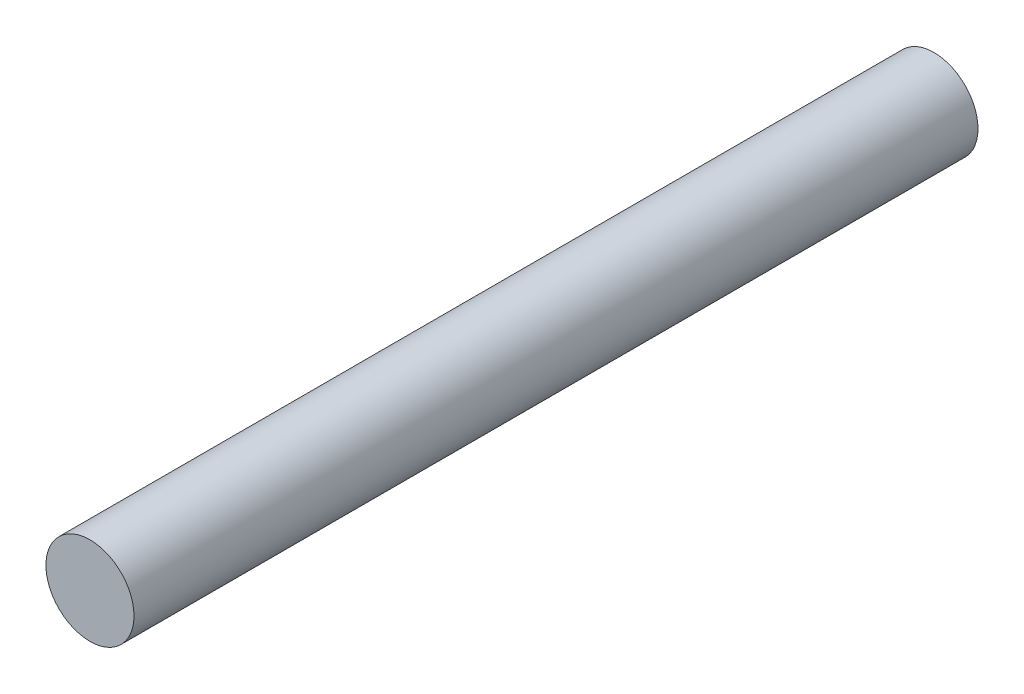
ISO-10303-21;
HEADER;
FILE_DESCRIPTION(('STEP AP214'),'2;1');
FILE_NAME('part.step','',(''),(''),'','','');
FILE_SCHEMA(('AUTOMOTIVE_DESIGN { 1 0 10303 214 1 1 1 1 }'));
ENDSEC;
DATA;
#1=APPLICATION_CONTEXT('core data for automotive mechanical design processes');
#2=APPLICATION_PROTOCOL_DEFINITION('international standard','automotive_design',2000,#1);
#3=PRODUCT_CONTEXT('',#1,'mechanical');
#4=PRODUCT('Part','Part','',(#3));
#5=PRODUCT_RELATED_PRODUCT_CATEGORY('part','',(#4));
#6=PRODUCT_DEFINITION_FORMATION('','',#4);
#7=PRODUCT_DEFINITION_CONTEXT('part definition',#1,'design');
#8=PRODUCT_DEFINITION('design','',#6,#7);
#9=PRODUCT_DEFINITION_SHAPE('','',#8);
#10=(LENGTH_UNIT() NAMED_UNIT(*) SI_UNIT(.MILLI.,.METRE.));
#11=(NAMED_UNIT(*) PLANE_ANGLE_UNIT() SI_UNIT($,.RADIAN.));
#12=(NAMED_UNIT(*) SI_UNIT($,.STERADIAN.) SOLID_ANGLE_UNIT());
#13=UNCERTAINTY_MEASURE_WITH_UNIT(LENGTH_MEASURE(1.E-05),#10,'distance_accuracy_value','');
#14=(GEOMETRIC_REPRESENTATION_CONTEXT(3) GLOBAL_UNCERTAINTY_ASSIGNED_CONTEXT((#13)) GLOBAL_UNIT_ASSIGNED_CONTEXT((#10,
#11,#12)) REPRESENTATION_CONTEXT('',''));
#15=CARTESIAN_POINT('',(0.,0.,0.));
#16=DIRECTION('',(0.,0.,1.));
#17=DIRECTION('',(1.,0.,0.));
#18=AXIS2_PLACEMENT_3D('',#15,#16,#17);
#19=CARTESIAN_POINT('',(0.,0.,115.));
#20=DIRECTION('',(0.,0.,-1.));
#21=DIRECTION('',(-1.,0.,0.));
#22=AXIS2_PLACEMENT_3D('',#19,#20,#21);
#23=CYLINDRICAL_SURFACE('',#22,6.);
#24=CARTESIAN_POINT('',(0.,0.,115.));
#25=DIRECTION('',(0.,0.,1.));
#26=DIRECTION('',(1.,0.,0.));
#27=AXIS2_PLACEMENT_3D('',#24,#25,#26);
#28=CIRCLE('',#27,6.);
#29=CARTESIAN_POINT('',(6.,0.,115.));
#30=VERTEX_POINT('',#29);
#31=EDGE_CURVE('E10',#30,#30,#28,.T.);
#32=ORIENTED_EDGE('',*,*,#31,.F.);
#33=EDGE_LOOP('',(#32));
#34=FACE_BOUND('',#33,.T.);
#35=CARTESIAN_POINT('',(0.,0.,0.));
#36=DIRECTION('',(0.,0.,1.));
#37=DIRECTION('',(1.,0.,0.));
#38=AXIS2_PLACEMENT_3D('',#35,#36,#37);
#39=CIRCLE('',#38,6.);
#40=CARTESIAN_POINT('',(6.,0.,0.));
#41=VERTEX_POINT('',#40);
#42=EDGE_CURVE('E36',#41,#41,#39,.T.);
#43=ORIENTED_EDGE('',*,*,#42,.T.);
#44=EDGE_LOOP('',(#43));
#45=FACE_BOUND('',#44,.T.);
#46=ADVANCED_FACE('F33',(#34,#45),#23,.T.);
#47=CARTESIAN_POINT('',(0.,0.,115.));
#48=DIRECTION('',(0.,0.,1.));
#49=DIRECTION('',(1.,0.,0.));
#50=AXIS2_PLACEMENT_3D('',#47,#48,#49);
#51=PLANE('',#50);
#52=ORIENTED_EDGE('',*,*,#31,.T.);
#53=EDGE_LOOP('',(#52));
#54=FACE_BOUND('',#53,.T.);
#55=ADVANCED_FACE('F48',(#54),#51,.T.);
#56=CARTESIAN_POINT('',(0.,0.,0.));
#57=DIRECTION('',(0.,0.,1.));
#58=DIRECTION('',(1.,0.,0.));
#59=AXIS2_PLACEMENT_3D('',#56,#57,#58);
#60=PLANE('',#59);
#61=ORIENTED_EDGE('',*,*,#42,.F.);
#62=EDGE_LOOP('',(#61));
#63=FACE_BOUND('',#62,.T.);
#64=ADVANCED_FACE('F46',(#63),#60,.F.);
#65=CLOSED_SHELL('',(#46,#55,#64));
#66=MANIFOLD_SOLID_BREP('B2',#65);
#67=ADVANCED_BREP_SHAPE_REPRESENTATION('',(#18,#66),#14);
#68=SHAPE_DEFINITION_REPRESENTATION(#9,#67);
ENDSEC;
END-ISO-10303-21;
